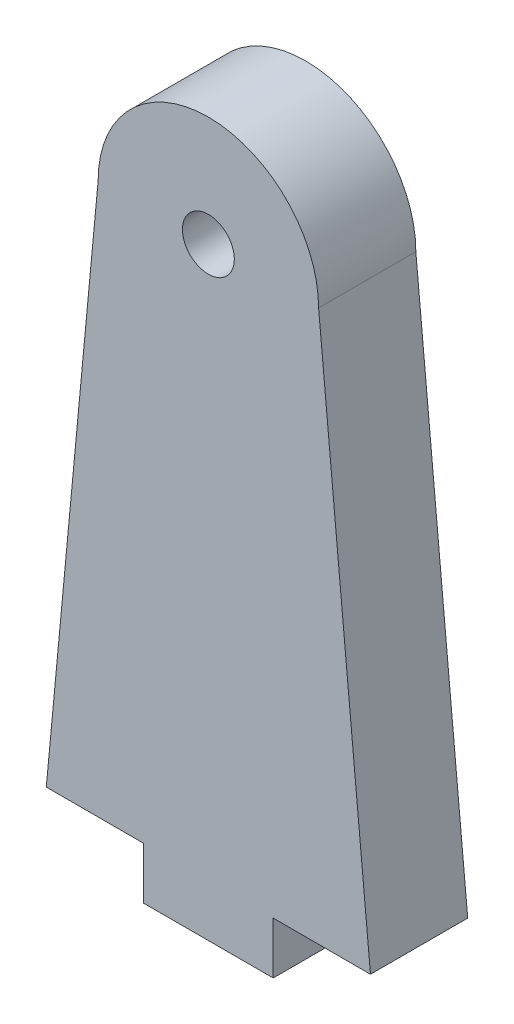
ISO-10303-21;
HEADER;
FILE_DESCRIPTION(('STEP AP214'),'2;1');
FILE_NAME('part.step','',(''),(''),'','','');
FILE_SCHEMA(('AUTOMOTIVE_DESIGN { 1 0 10303 214 1 1 1 1 }'));
ENDSEC;
DATA;
#1=APPLICATION_CONTEXT('core data for automotive mechanical design processes');
#2=APPLICATION_PROTOCOL_DEFINITION('international standard','automotive_design',2000,#1);
#3=PRODUCT_CONTEXT('',#1,'mechanical');
#4=PRODUCT('Part','Part','',(#3));
#5=PRODUCT_RELATED_PRODUCT_CATEGORY('part','',(#4));
#6=PRODUCT_DEFINITION_FORMATION('','',#4);
#7=PRODUCT_DEFINITION_CONTEXT('part definition',#1,'design');
#8=PRODUCT_DEFINITION('design','',#6,#7);
#9=PRODUCT_DEFINITION_SHAPE('','',#8);
#10=(LENGTH_UNIT() NAMED_UNIT(*) SI_UNIT(.MILLI.,.METRE.));
#11=(NAMED_UNIT(*) PLANE_ANGLE_UNIT() SI_UNIT($,.RADIAN.));
#12=(NAMED_UNIT(*) SI_UNIT($,.STERADIAN.) SOLID_ANGLE_UNIT());
#13=UNCERTAINTY_MEASURE_WITH_UNIT(LENGTH_MEASURE(1.E-05),#10,'distance_accuracy_value','');
#14=(GEOMETRIC_REPRESENTATION_CONTEXT(3) GLOBAL_UNCERTAINTY_ASSIGNED_CONTEXT((#13)) GLOBAL_UNIT_ASSIGNED_CONTEXT((#10,
#11,#12)) REPRESENTATION_CONTEXT('',''));
#15=CARTESIAN_POINT('',(0.,0.,0.));
#16=DIRECTION('',(0.,0.,1.));
#17=DIRECTION('',(1.,0.,0.));
#18=AXIS2_PLACEMENT_3D('',#15,#16,#17);
#19=CARTESIAN_POINT('',(0.,93.,15.));
#20=DIRECTION('',(0.,0.,1.));
#21=DIRECTION('',(1.,0.,0.));
#22=AXIS2_PLACEMENT_3D('',#19,#20,#21);
#23=PLANE('',#22);
#24=DIRECTION('',(0.,1.,0.));
#25=VECTOR('',#24,1.);
#26=CARTESIAN_POINT('',(10.,0.,15.));
#27=LINE('',#26,#25);
#28=CARTESIAN_POINT('',(10.,0.,15.));
#29=VERTEX_POINT('',#28);
#30=CARTESIAN_POINT('',(10.,8.,15.));
#31=VERTEX_POINT('',#30);
#32=EDGE_CURVE('E151',#29,#31,#27,.T.);
#33=ORIENTED_EDGE('',*,*,#32,.T.);
#34=DIRECTION('',(1.,0.,0.));
#35=VECTOR('',#34,1.);
#36=CARTESIAN_POINT('',(10.,8.,15.));
#37=LINE('',#36,#35);
#38=CARTESIAN_POINT('',(25.,8.,15.));
#39=VERTEX_POINT('',#38);
#40=EDGE_CURVE('E98',#31,#39,#37,.T.);
#41=ORIENTED_EDGE('',*,*,#40,.T.);
#42=DIRECTION('',(-0.0937035429320521,0.995600143653054,0.));
#43=VECTOR('',#42,1.);
#44=CARTESIAN_POINT('',(17.,93.,15.));
#45=LINE('',#44,#43);
#46=CARTESIAN_POINT('',(17.,93.,15.));
#47=VERTEX_POINT('',#46);
#48=EDGE_CURVE('E166',#39,#47,#45,.T.);
#49=ORIENTED_EDGE('',*,*,#48,.T.);
#50=CARTESIAN_POINT('',(0.,93.,15.));
#51=DIRECTION('',(0.,0.,1.));
#52=DIRECTION('',(1.,0.,0.));
#53=AXIS2_PLACEMENT_3D('',#50,#51,#52);
#54=CIRCLE('',#53,17.);
#55=CARTESIAN_POINT('',(-17.,93.,15.));
#56=VERTEX_POINT('',#55);
#57=EDGE_CURVE('E179',#47,#56,#54,.T.);
#58=ORIENTED_EDGE('',*,*,#57,.T.);
#59=DIRECTION('',(-0.0937035429320521,-0.995600143653054,0.));
#60=VECTOR('',#59,1.);
#61=CARTESIAN_POINT('',(-17.,93.,15.));
#62=LINE('',#61,#60);
#63=CARTESIAN_POINT('',(-25.,8.,15.));
#64=VERTEX_POINT('',#63);
#65=EDGE_CURVE('E118',#56,#64,#62,.T.);
#66=ORIENTED_EDGE('',*,*,#65,.T.);
#67=DIRECTION('',(1.,0.,0.));
#68=VECTOR('',#67,1.);
#69=CARTESIAN_POINT('',(-10.,8.,15.));
#70=LINE('',#69,#68);
#71=CARTESIAN_POINT('',(-10.,8.,15.));
#72=VERTEX_POINT('',#71);
#73=EDGE_CURVE('E112',#64,#72,#70,.T.);
#74=ORIENTED_EDGE('',*,*,#73,.T.);
#75=DIRECTION('',(0.,-1.,0.));
#76=VECTOR('',#75,1.);
#77=CARTESIAN_POINT('',(-10.,0.,15.));
#78=LINE('',#77,#76);
#79=CARTESIAN_POINT('',(-10.,0.,15.));
#80=VERTEX_POINT('',#79);
#81=EDGE_CURVE('E116',#72,#80,#78,.T.);
#82=ORIENTED_EDGE('',*,*,#81,.T.);
#83=DIRECTION('',(1.,0.,0.));
#84=VECTOR('',#83,1.);
#85=CARTESIAN_POINT('',(-10.,0.,15.));
#86=LINE('',#85,#84);
#87=EDGE_CURVE('E54',#80,#29,#86,.T.);
#88=ORIENTED_EDGE('',*,*,#87,.T.);
#89=EDGE_LOOP('',(#33,#41,#49,#58,#66,#74,#82,#88));
#90=FACE_BOUND('',#89,.T.);
#91=CARTESIAN_POINT('',(0.,93.,15.));
#92=DIRECTION('',(0.,0.,1.));
#93=DIRECTION('',(1.,0.,0.));
#94=AXIS2_PLACEMENT_3D('',#91,#92,#93);
#95=CIRCLE('',#94,4.);
#96=CARTESIAN_POINT('',(4.,93.,15.));
#97=VERTEX_POINT('',#96);
#98=EDGE_CURVE('E191',#97,#97,#95,.T.);
#99=ORIENTED_EDGE('',*,*,#98,.F.);
#100=EDGE_LOOP('',(#99));
#101=FACE_BOUND('',#100,.T.);
#102=ADVANCED_FACE('F37',(#90,#101),#23,.T.);
#103=CARTESIAN_POINT('',(0.,93.,0.));
#104=DIRECTION('',(0.,0.,1.));
#105=DIRECTION('',(1.,0.,0.));
#106=AXIS2_PLACEMENT_3D('',#103,#104,#105);
#107=PLANE('',#106);
#108=DIRECTION('',(0.,1.,0.));
#109=VECTOR('',#108,1.);
#110=CARTESIAN_POINT('',(10.,0.,0.));
#111=LINE('',#110,#109);
#112=CARTESIAN_POINT('',(10.,0.,0.));
#113=VERTEX_POINT('',#112);
#114=CARTESIAN_POINT('',(10.,8.,0.));
#115=VERTEX_POINT('',#114);
#116=EDGE_CURVE('E136',#113,#115,#111,.T.);
#117=ORIENTED_EDGE('',*,*,#116,.F.);
#118=DIRECTION('',(1.,0.,0.));
#119=VECTOR('',#118,1.);
#120=CARTESIAN_POINT('',(-10.,0.,0.));
#121=LINE('',#120,#119);
#122=CARTESIAN_POINT('',(-10.,0.,0.));
#123=VERTEX_POINT('',#122);
#124=EDGE_CURVE('E90',#123,#113,#121,.T.);
#125=ORIENTED_EDGE('',*,*,#124,.F.);
#126=DIRECTION('',(0.,-1.,0.));
#127=VECTOR('',#126,1.);
#128=CARTESIAN_POINT('',(-10.,0.,0.));
#129=LINE('',#128,#127);
#130=CARTESIAN_POINT('',(-10.,8.,0.));
#131=VERTEX_POINT('',#130);
#132=EDGE_CURVE('E84',#131,#123,#129,.T.);
#133=ORIENTED_EDGE('',*,*,#132,.F.);
#134=DIRECTION('',(1.,0.,0.));
#135=VECTOR('',#134,1.);
#136=CARTESIAN_POINT('',(-10.,8.,0.));
#137=LINE('',#136,#135);
#138=CARTESIAN_POINT('',(-25.,8.,0.));
#139=VERTEX_POINT('',#138);
#140=EDGE_CURVE('E126',#139,#131,#137,.T.);
#141=ORIENTED_EDGE('',*,*,#140,.F.);
#142=DIRECTION('',(-0.0937035429320521,-0.995600143653054,0.));
#143=VECTOR('',#142,1.);
#144=CARTESIAN_POINT('',(-17.,93.,0.));
#145=LINE('',#144,#143);
#146=CARTESIAN_POINT('',(-17.,93.,0.));
#147=VERTEX_POINT('',#146);
#148=EDGE_CURVE('E146',#147,#139,#145,.T.);
#149=ORIENTED_EDGE('',*,*,#148,.F.);
#150=CARTESIAN_POINT('',(0.,93.,0.));
#151=DIRECTION('',(0.,0.,1.));
#152=DIRECTION('',(1.,0.,0.));
#153=AXIS2_PLACEMENT_3D('',#150,#151,#152);
#154=CIRCLE('',#153,17.);
#155=CARTESIAN_POINT('',(17.,93.,0.));
#156=VERTEX_POINT('',#155);
#157=EDGE_CURVE('E144',#156,#147,#154,.T.);
#158=ORIENTED_EDGE('',*,*,#157,.F.);
#159=DIRECTION('',(-0.0937035429320521,0.995600143653054,0.));
#160=VECTOR('',#159,1.);
#161=CARTESIAN_POINT('',(17.,93.,0.));
#162=LINE('',#161,#160);
#163=CARTESIAN_POINT('',(25.,8.,0.));
#164=VERTEX_POINT('',#163);
#165=EDGE_CURVE('E142',#164,#156,#162,.T.);
#166=ORIENTED_EDGE('',*,*,#165,.F.);
#167=DIRECTION('',(1.,0.,0.));
#168=VECTOR('',#167,1.);
#169=CARTESIAN_POINT('',(10.,8.,0.));
#170=LINE('',#169,#168);
#171=EDGE_CURVE('E139',#115,#164,#170,.T.);
#172=ORIENTED_EDGE('',*,*,#171,.F.);
#173=EDGE_LOOP('',(#117,#125,#133,#141,#149,#158,#166,#172));
#174=FACE_BOUND('',#173,.T.);
#175=CARTESIAN_POINT('',(0.,93.,0.));
#176=DIRECTION('',(0.,0.,1.));
#177=DIRECTION('',(1.,0.,0.));
#178=AXIS2_PLACEMENT_3D('',#175,#176,#177);
#179=CIRCLE('',#178,4.);
#180=CARTESIAN_POINT('',(4.,93.,0.));
#181=VERTEX_POINT('',#180);
#182=EDGE_CURVE('E190',#181,#181,#179,.T.);
#183=ORIENTED_EDGE('',*,*,#182,.T.);
#184=EDGE_LOOP('',(#183));
#185=FACE_BOUND('',#184,.T.);
#186=ADVANCED_FACE('F170',(#174,#185),#107,.F.);
#187=CARTESIAN_POINT('',(10.,0.,15.));
#188=DIRECTION('',(-1.,0.,0.));
#189=DIRECTION('',(0.,0.,1.));
#190=AXIS2_PLACEMENT_3D('',#187,#188,#189);
#191=PLANE('',#190);
#192=ORIENTED_EDGE('',*,*,#116,.T.);
#193=DIRECTION('',(0.,0.,-1.));
#194=VECTOR('',#193,1.);
#195=CARTESIAN_POINT('',(10.,8.,15.));
#196=LINE('',#195,#194);
#197=EDGE_CURVE('E11',#31,#115,#196,.T.);
#198=ORIENTED_EDGE('',*,*,#197,.F.);
#199=ORIENTED_EDGE('',*,*,#32,.F.);
#200=DIRECTION('',(0.,0.,-1.));
#201=VECTOR('',#200,1.);
#202=CARTESIAN_POINT('',(10.,0.,15.));
#203=LINE('',#202,#201);
#204=EDGE_CURVE('E132',#29,#113,#203,.T.);
#205=ORIENTED_EDGE('',*,*,#204,.T.);
#206=EDGE_LOOP('',(#192,#198,#199,#205));
#207=FACE_BOUND('',#206,.T.);
#208=ADVANCED_FACE('F39',(#207),#191,.F.);
#209=CARTESIAN_POINT('',(10.,8.,15.));
#210=DIRECTION('',(0.,1.,0.));
#211=DIRECTION('',(-1.,0.,0.));
#212=AXIS2_PLACEMENT_3D('',#209,#210,#211);
#213=PLANE('',#212);
#214=ORIENTED_EDGE('',*,*,#171,.T.);
#215=DIRECTION('',(0.,0.,-1.));
#216=VECTOR('',#215,1.);
#217=CARTESIAN_POINT('',(25.,8.,15.));
#218=LINE('',#217,#216);
#219=EDGE_CURVE('E46',#39,#164,#218,.T.);
#220=ORIENTED_EDGE('',*,*,#219,.F.);
#221=ORIENTED_EDGE('',*,*,#40,.F.);
#222=ORIENTED_EDGE('',*,*,#197,.T.);
#223=EDGE_LOOP('',(#214,#220,#221,#222));
#224=FACE_BOUND('',#223,.T.);
#225=ADVANCED_FACE('F227',(#224),#213,.F.);
#226=CARTESIAN_POINT('',(17.,93.,15.));
#227=DIRECTION('',(-0.995600143653054,-0.0937035429320521,0.));
#228=DIRECTION('',(0.0937035429320521,-0.995600143653054,0.));
#229=AXIS2_PLACEMENT_3D('',#226,#227,#228);
#230=PLANE('',#229);
#231=ORIENTED_EDGE('',*,*,#165,.T.);
#232=DIRECTION('',(0.,0.,-1.));
#233=VECTOR('',#232,1.);
#234=CARTESIAN_POINT('',(17.,93.,15.));
#235=LINE('',#234,#233);
#236=EDGE_CURVE('E158',#47,#156,#235,.T.);
#237=ORIENTED_EDGE('',*,*,#236,.F.);
#238=ORIENTED_EDGE('',*,*,#48,.F.);
#239=ORIENTED_EDGE('',*,*,#219,.T.);
#240=EDGE_LOOP('',(#231,#237,#238,#239));
#241=FACE_BOUND('',#240,.T.);
#242=ADVANCED_FACE('F164',(#241),#230,.F.);
#243=CARTESIAN_POINT('',(0.,93.,15.));
#244=DIRECTION('',(0.,0.,-1.));
#245=DIRECTION('',(-1.,0.,0.));
#246=AXIS2_PLACEMENT_3D('',#243,#244,#245);
#247=CYLINDRICAL_SURFACE('',#246,17.);
#248=ORIENTED_EDGE('',*,*,#157,.T.);
#249=DIRECTION('',(0.,0.,-1.));
#250=VECTOR('',#249,1.);
#251=CARTESIAN_POINT('',(-17.,93.,15.));
#252=LINE('',#251,#250);
#253=EDGE_CURVE('E155',#56,#147,#252,.T.);
#254=ORIENTED_EDGE('',*,*,#253,.F.);
#255=ORIENTED_EDGE('',*,*,#57,.F.);
#256=ORIENTED_EDGE('',*,*,#236,.T.);
#257=EDGE_LOOP('',(#248,#254,#255,#256));
#258=FACE_BOUND('',#257,.T.);
#259=ADVANCED_FACE('F175',(#258),#247,.T.);
#260=CARTESIAN_POINT('',(-17.,93.,15.));
#261=DIRECTION('',(0.995600143653054,-0.0937035429320521,0.));
#262=DIRECTION('',(0.0937035429320521,0.995600143653054,0.));
#263=AXIS2_PLACEMENT_3D('',#260,#261,#262);
#264=PLANE('',#263);
#265=ORIENTED_EDGE('',*,*,#148,.T.);
#266=DIRECTION('',(0.,0.,-1.));
#267=VECTOR('',#266,1.);
#268=CARTESIAN_POINT('',(-25.,8.,15.));
#269=LINE('',#268,#267);
#270=EDGE_CURVE('E127',#64,#139,#269,.T.);
#271=ORIENTED_EDGE('',*,*,#270,.F.);
#272=ORIENTED_EDGE('',*,*,#65,.F.);
#273=ORIENTED_EDGE('',*,*,#253,.T.);
#274=EDGE_LOOP('',(#265,#271,#272,#273));
#275=FACE_BOUND('',#274,.T.);
#276=ADVANCED_FACE('F178',(#275),#264,.F.);
#277=CARTESIAN_POINT('',(-10.,8.,15.));
#278=DIRECTION('',(0.,1.,0.));
#279=DIRECTION('',(-1.,0.,0.));
#280=AXIS2_PLACEMENT_3D('',#277,#278,#279);
#281=PLANE('',#280);
#282=ORIENTED_EDGE('',*,*,#140,.T.);
#283=DIRECTION('',(0.,0.,-1.));
#284=VECTOR('',#283,1.);
#285=CARTESIAN_POINT('',(-10.,8.,15.));
#286=LINE('',#285,#284);
#287=EDGE_CURVE('E123',#72,#131,#286,.T.);
#288=ORIENTED_EDGE('',*,*,#287,.F.);
#289=ORIENTED_EDGE('',*,*,#73,.F.);
#290=ORIENTED_EDGE('',*,*,#270,.T.);
#291=EDGE_LOOP('',(#282,#288,#289,#290));
#292=FACE_BOUND('',#291,.T.);
#293=ADVANCED_FACE('F124',(#292),#281,.F.);
#294=CARTESIAN_POINT('',(-10.,0.,15.));
#295=DIRECTION('',(1.,0.,0.));
#296=DIRECTION('',(0.,0.,-1.));
#297=AXIS2_PLACEMENT_3D('',#294,#295,#296);
#298=PLANE('',#297);
#299=ORIENTED_EDGE('',*,*,#132,.T.);
#300=DIRECTION('',(0.,0.,-1.));
#301=VECTOR('',#300,1.);
#302=CARTESIAN_POINT('',(-10.,0.,15.));
#303=LINE('',#302,#301);
#304=EDGE_CURVE('E128',#80,#123,#303,.T.);
#305=ORIENTED_EDGE('',*,*,#304,.F.);
#306=ORIENTED_EDGE('',*,*,#81,.F.);
#307=ORIENTED_EDGE('',*,*,#287,.T.);
#308=EDGE_LOOP('',(#299,#305,#306,#307));
#309=FACE_BOUND('',#308,.T.);
#310=ADVANCED_FACE('F130',(#309),#298,.F.);
#311=CARTESIAN_POINT('',(-10.,0.,15.));
#312=DIRECTION('',(0.,1.,0.));
#313=DIRECTION('',(0.,0.,1.));
#314=AXIS2_PLACEMENT_3D('',#311,#312,#313);
#315=PLANE('',#314);
#316=CARTESIAN_POINT('',(0.,0.,7.5));
#317=DIRECTION('',(0.,-1.,0.));
#318=DIRECTION('',(0.,0.,-1.));
#319=AXIS2_PLACEMENT_3D('',#316,#317,#318);
#320=CIRCLE('',#319,4.);
#321=CARTESIAN_POINT('',(0.,0.,3.5));
#322=VERTEX_POINT('',#321);
#323=EDGE_CURVE('E187',#322,#322,#320,.T.);
#324=ORIENTED_EDGE('',*,*,#323,.F.);
#325=EDGE_LOOP('',(#324));
#326=FACE_BOUND('',#325,.T.);
#327=ORIENTED_EDGE('',*,*,#124,.T.);
#328=ORIENTED_EDGE('',*,*,#204,.F.);
#329=ORIENTED_EDGE('',*,*,#87,.F.);
#330=ORIENTED_EDGE('',*,*,#304,.T.);
#331=EDGE_LOOP('',(#327,#328,#329,#330));
#332=FACE_BOUND('',#331,.T.);
#333=ADVANCED_FACE('F214',(#326,#332),#315,.F.);
#334=CARTESIAN_POINT('',(0.,30.,7.5));
#335=DIRECTION('',(0.,-1.,0.));
#336=DIRECTION('',(0.,0.,-1.));
#337=AXIS2_PLACEMENT_3D('',#334,#335,#336);
#338=CONICAL_SURFACE('',#337,4.,1.02974425867665);
#339=CARTESIAN_POINT('',(0.,32.4034424761102,7.5));
#340=VERTEX_POINT('',#339);
#341=VERTEX_LOOP('',#340);
#342=FACE_BOUND('',#341,.T.);
#343=CARTESIAN_POINT('',(0.,30.,7.5));
#344=DIRECTION('',(0.,-1.,0.));
#345=DIRECTION('',(0.,0.,-1.));
#346=AXIS2_PLACEMENT_3D('',#343,#344,#345);
#347=CIRCLE('',#346,4.);
#348=CARTESIAN_POINT('',(0.,30.,3.5));
#349=VERTEX_POINT('',#348);
#350=EDGE_CURVE('E140',#349,#349,#347,.T.);
#351=ORIENTED_EDGE('',*,*,#350,.T.);
#352=EDGE_LOOP('',(#351));
#353=FACE_BOUND('',#352,.T.);
#354=ADVANCED_FACE('F211',(#342,#353),#338,.F.);
#355=CARTESIAN_POINT('',(0.,0.,7.5));
#356=DIRECTION('',(0.,-1.,0.));
#357=DIRECTION('',(0.,0.,-1.));
#358=AXIS2_PLACEMENT_3D('',#355,#356,#357);
#359=CYLINDRICAL_SURFACE('',#358,4.);
#360=ORIENTED_EDGE('',*,*,#350,.F.);
#361=EDGE_LOOP('',(#360));
#362=FACE_BOUND('',#361,.T.);
#363=ORIENTED_EDGE('',*,*,#323,.T.);
#364=EDGE_LOOP('',(#363));
#365=FACE_BOUND('',#364,.T.);
#366=ADVANCED_FACE('F200',(#362,#365),#359,.F.);
#367=CARTESIAN_POINT('',(0.,93.,0.));
#368=DIRECTION('',(0.,0.,1.));
#369=DIRECTION('',(1.,0.,0.));
#370=AXIS2_PLACEMENT_3D('',#367,#368,#369);
#371=CYLINDRICAL_SURFACE('',#370,4.);
#372=ORIENTED_EDGE('',*,*,#182,.F.);
#373=EDGE_LOOP('',(#372));
#374=FACE_BOUND('',#373,.T.);
#375=ORIENTED_EDGE('',*,*,#98,.T.);
#376=EDGE_LOOP('',(#375));
#377=FACE_BOUND('',#376,.T.);
#378=ADVANCED_FACE('F197',(#374,#377),#371,.F.);
#379=CLOSED_SHELL('',(#102,#186,#208,#225,#242,#259,#276,#293,#310,#333,#354,#366,#378));
#380=MANIFOLD_SOLID_BREP('B2',#379);
#381=ADVANCED_BREP_SHAPE_REPRESENTATION('',(#18,#380),#14);
#382=SHAPE_DEFINITION_REPRESENTATION(#9,#381);
ENDSEC;
END-ISO-10303-21;
